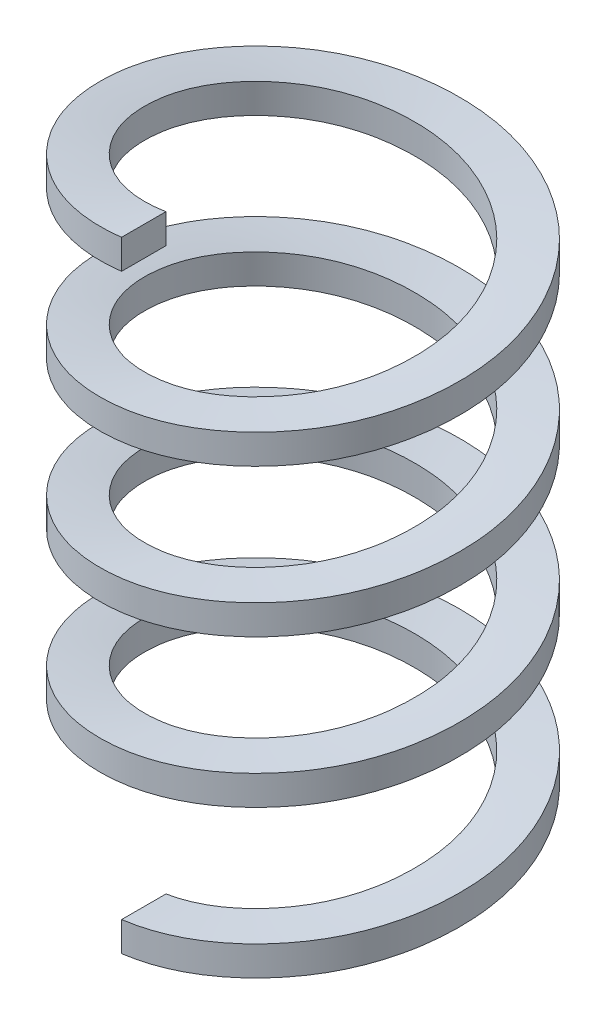
ISO-10303-21;
HEADER;
FILE_DESCRIPTION(('STEP AP214'),'2;1');
FILE_NAME('part.step','',(''),(''),'','','');
FILE_SCHEMA(('AUTOMOTIVE_DESIGN { 1 0 10303 214 1 1 1 1 }'));
ENDSEC;
DATA;
#1=APPLICATION_CONTEXT('core data for automotive mechanical design processes');
#2=APPLICATION_PROTOCOL_DEFINITION('international standard','automotive_design',2000,#1);
#3=PRODUCT_CONTEXT('',#1,'mechanical');
#4=PRODUCT('Part','Part','',(#3));
#5=PRODUCT_RELATED_PRODUCT_CATEGORY('part','',(#4));
#6=PRODUCT_DEFINITION_FORMATION('','',#4);
#7=PRODUCT_DEFINITION_CONTEXT('part definition',#1,'design');
#8=PRODUCT_DEFINITION('design','',#6,#7);
#9=PRODUCT_DEFINITION_SHAPE('','',#8);
#10=(LENGTH_UNIT() NAMED_UNIT(*) SI_UNIT(.MILLI.,.METRE.));
#11=(NAMED_UNIT(*) PLANE_ANGLE_UNIT() SI_UNIT($,.RADIAN.));
#12=(NAMED_UNIT(*) SI_UNIT($,.STERADIAN.) SOLID_ANGLE_UNIT());
#13=UNCERTAINTY_MEASURE_WITH_UNIT(LENGTH_MEASURE(1.E-05),#10,'distance_accuracy_value','');
#14=(GEOMETRIC_REPRESENTATION_CONTEXT(3) GLOBAL_UNCERTAINTY_ASSIGNED_CONTEXT((#13)) GLOBAL_UNIT_ASSIGNED_CONTEXT((#10,
#11,#12)) REPRESENTATION_CONTEXT('',''));
#15=CARTESIAN_POINT('',(0.,0.,0.));
#16=DIRECTION('',(0.,0.,1.));
#17=DIRECTION('',(1.,0.,0.));
#18=AXIS2_PLACEMENT_3D('',#15,#16,#17);
#19=CARTESIAN_POINT('',(0.,-69.85,13.686869772002));
#20=DIRECTION('',(1.,0.,0.));
#21=DIRECTION('',(0.,1.,0.));
#22=AXIS2_PLACEMENT_3D('',#19,#20,#21);
#23=PLANE('',#22);
#24=DIRECTION('',(0.,0.,1.));
#25=VECTOR('',#24,1.);
#26=CARTESIAN_POINT('',(0.,-71.12,13.7215008808548));
#27=LINE('',#26,#25);
#28=CARTESIAN_POINT('',(0.,-71.12,15.591869772002));
#29=VERTEX_POINT('',#28);
#30=CARTESIAN_POINT('',(0.,-71.12,11.781869772002));
#31=VERTEX_POINT('',#30);
#32=EDGE_CURVE('E74',#29,#31,#27,.F.);
#33=ORIENTED_EDGE('',*,*,#32,.F.);
#34=DIRECTION('',(0.,1.,0.));
#35=VECTOR('',#34,1.);
#36=CARTESIAN_POINT('',(0.,-70.358,15.591869772002));
#37=LINE('',#36,#35);
#38=CARTESIAN_POINT('',(0.,-68.58,15.591869772002));
#39=VERTEX_POINT('',#38);
#40=EDGE_CURVE('E58',#39,#29,#37,.F.);
#41=ORIENTED_EDGE('',*,*,#40,.F.);
#42=DIRECTION('',(0.,0.,1.));
#43=VECTOR('',#42,1.);
#44=CARTESIAN_POINT('',(0.,-68.58,13.7215008808548));
#45=LINE('',#44,#43);
#46=CARTESIAN_POINT('',(0.,-68.58,11.781869772002));
#47=VERTEX_POINT('',#46);
#48=EDGE_CURVE('E64',#47,#39,#45,.T.);
#49=ORIENTED_EDGE('',*,*,#48,.F.);
#50=DIRECTION('',(0.,1.,0.));
#51=VECTOR('',#50,1.);
#52=CARTESIAN_POINT('',(0.,-70.358,11.781869772002));
#53=LINE('',#52,#51);
#54=EDGE_CURVE('E70',#31,#47,#53,.T.);
#55=ORIENTED_EDGE('',*,*,#54,.F.);
#56=EDGE_LOOP('',(#33,#41,#49,#55));
#57=FACE_BOUND('',#56,.T.);
#58=ADVANCED_FACE('F16',(#57),#23,.F.);
#59=CARTESIAN_POINT('',(0.,-19.05,13.686869772002));
#60=DIRECTION('',(1.,0.,0.));
#61=DIRECTION('',(0.,1.,0.));
#62=AXIS2_PLACEMENT_3D('',#59,#60,#61);
#63=PLANE('',#62);
#64=DIRECTION('',(0.,0.,1.));
#65=VECTOR('',#64,1.);
#66=CARTESIAN_POINT('',(0.,-20.32,13.7215008808548));
#67=LINE('',#66,#65);
#68=CARTESIAN_POINT('',(0.,-20.32,15.591869772002));
#69=VERTEX_POINT('',#68);
#70=CARTESIAN_POINT('',(0.,-20.32,11.781869772002));
#71=VERTEX_POINT('',#70);
#72=EDGE_CURVE('E91',#69,#71,#67,.F.);
#73=ORIENTED_EDGE('',*,*,#72,.T.);
#74=DIRECTION('',(0.,1.,0.));
#75=VECTOR('',#74,1.);
#76=CARTESIAN_POINT('',(0.,-19.558,11.781869772002));
#77=LINE('',#76,#75);
#78=CARTESIAN_POINT('',(0.,-17.78,11.781869772002));
#79=VERTEX_POINT('',#78);
#80=EDGE_CURVE('E44',#71,#79,#77,.T.);
#81=ORIENTED_EDGE('',*,*,#80,.T.);
#82=DIRECTION('',(0.,0.,1.));
#83=VECTOR('',#82,1.);
#84=CARTESIAN_POINT('',(0.,-17.78,13.7215008808548));
#85=LINE('',#84,#83);
#86=CARTESIAN_POINT('',(0.,-17.78,15.591869772002));
#87=VERTEX_POINT('',#86);
#88=EDGE_CURVE('E24',#79,#87,#85,.T.);
#89=ORIENTED_EDGE('',*,*,#88,.T.);
#90=DIRECTION('',(0.,1.,0.));
#91=VECTOR('',#90,1.);
#92=CARTESIAN_POINT('',(0.,-19.558,15.591869772002));
#93=LINE('',#92,#91);
#94=EDGE_CURVE('E10',#87,#69,#93,.F.);
#95=ORIENTED_EDGE('',*,*,#94,.T.);
#96=EDGE_LOOP('',(#73,#81,#89,#95));
#97=FACE_BOUND('',#96,.T.);
#98=ADVANCED_FACE('F134',(#97),#63,.T.);
#99=CARTESIAN_POINT('',(0.,-71.12,15.591869772002));
#100=CARTESIAN_POINT('',(6.45836392231832,-70.32625,15.591869772002));
#101=CARTESIAN_POINT('',(11.0251168471601,-69.5325,11.0251168471601));
#102=CARTESIAN_POINT('',(15.591869772002,-68.73875,6.45836392231832));
#103=CARTESIAN_POINT('',(15.591869772002,-67.945,0.));
#104=CARTESIAN_POINT('',(15.591869772002,-67.15125,-6.45836392231832));
#105=CARTESIAN_POINT('',(11.0251168471601,-66.3575,-11.0251168471601));
#106=CARTESIAN_POINT('',(6.45836392231832,-65.56375,-15.591869772002));
#107=CARTESIAN_POINT('',(0.,-64.77,-15.591869772002));
#108=CARTESIAN_POINT('',(-6.45836392231832,-63.97625,-15.591869772002));
#109=CARTESIAN_POINT('',(-11.0251168471601,-63.1825,-11.0251168471601));
#110=CARTESIAN_POINT('',(-15.591869772002,-62.3887500000001,-6.45836392231833));
#111=CARTESIAN_POINT('',(-15.591869772002,-61.595,0.));
#112=CARTESIAN_POINT('',(-15.591869772002,-60.80125,6.45836392231832));
#113=CARTESIAN_POINT('',(-11.0251168471601,-60.0075,11.0251168471601));
#114=CARTESIAN_POINT('',(-6.45836392231833,-59.21375,15.591869772002));
#115=CARTESIAN_POINT('',(0.,-58.42,15.591869772002));
#116=CARTESIAN_POINT('',(6.45836392231832,-57.6262500000001,15.591869772002));
#117=CARTESIAN_POINT('',(11.0251168471601,-56.8325,11.0251168471601));
#118=CARTESIAN_POINT('',(15.591869772002,-56.03875,6.45836392231832));
#119=CARTESIAN_POINT('',(15.591869772002,-55.245,0.));
#120=CARTESIAN_POINT('',(15.591869772002,-54.45125,-6.45836392231832));
#121=CARTESIAN_POINT('',(11.0251168471601,-53.6575,-11.0251168471601));
#122=CARTESIAN_POINT('',(6.45836392231832,-52.8637500000001,-15.591869772002));
#123=CARTESIAN_POINT('',(0.,-52.07,-15.591869772002));
#124=CARTESIAN_POINT('',(-6.45836392231832,-51.27625,-15.591869772002));
#125=CARTESIAN_POINT('',(-11.0251168471601,-50.4825,-11.0251168471601));
#126=CARTESIAN_POINT('',(-15.591869772002,-49.68875,-6.45836392231833));
#127=CARTESIAN_POINT('',(-15.591869772002,-48.895,0.));
#128=CARTESIAN_POINT('',(-15.591869772002,-48.10125,6.45836392231832));
#129=CARTESIAN_POINT('',(-11.0251168471601,-47.3075,11.0251168471601));
#130=CARTESIAN_POINT('',(-6.45836392231833,-46.51375,15.591869772002));
#131=CARTESIAN_POINT('',(0.,-45.72,15.591869772002));
#132=CARTESIAN_POINT('',(6.45836392231832,-44.92625,15.591869772002));
#133=CARTESIAN_POINT('',(11.0251168471601,-44.1325,11.0251168471601));
#134=CARTESIAN_POINT('',(15.591869772002,-43.33875,6.45836392231832));
#135=CARTESIAN_POINT('',(15.591869772002,-42.545,0.));
#136=CARTESIAN_POINT('',(15.591869772002,-41.75125,-6.45836392231832));
#137=CARTESIAN_POINT('',(11.0251168471601,-40.9575,-11.0251168471601));
#138=CARTESIAN_POINT('',(6.45836392231832,-40.16375,-15.591869772002));
#139=CARTESIAN_POINT('',(0.,-39.37,-15.591869772002));
#140=CARTESIAN_POINT('',(-6.45836392231832,-38.57625,-15.591869772002));
#141=CARTESIAN_POINT('',(-11.0251168471601,-37.7825,-11.0251168471601));
#142=CARTESIAN_POINT('',(-15.591869772002,-36.98875,-6.45836392231833));
#143=CARTESIAN_POINT('',(-15.591869772002,-36.195,0.));
#144=CARTESIAN_POINT('',(-15.591869772002,-35.40125,6.45836392231832));
#145=CARTESIAN_POINT('',(-11.0251168471601,-34.6075,11.0251168471601));
#146=CARTESIAN_POINT('',(-6.45836392231833,-33.81375,15.591869772002));
#147=CARTESIAN_POINT('',(0.,-33.02,15.591869772002));
#148=CARTESIAN_POINT('',(6.45836392231832,-32.22625,15.591869772002));
#149=CARTESIAN_POINT('',(11.0251168471601,-31.4325,11.0251168471601));
#150=CARTESIAN_POINT('',(15.591869772002,-30.63875,6.45836392231832));
#151=CARTESIAN_POINT('',(15.591869772002,-29.845,0.));
#152=CARTESIAN_POINT('',(15.591869772002,-29.05125,-6.45836392231832));
#153=CARTESIAN_POINT('',(11.0251168471601,-28.2575,-11.0251168471601));
#154=CARTESIAN_POINT('',(6.45836392231832,-27.46375,-15.591869772002));
#155=CARTESIAN_POINT('',(0.,-26.67,-15.591869772002));
#156=CARTESIAN_POINT('',(-6.45836392231832,-25.87625,-15.591869772002));
#157=CARTESIAN_POINT('',(-11.0251168471601,-25.0825,-11.0251168471601));
#158=CARTESIAN_POINT('',(-15.591869772002,-24.28875,-6.45836392231833));
#159=CARTESIAN_POINT('',(-15.591869772002,-23.495,0.));
#160=CARTESIAN_POINT('',(-15.591869772002,-22.70125,6.45836392231832));
#161=CARTESIAN_POINT('',(-11.0251168471601,-21.9075,11.0251168471601));
#162=CARTESIAN_POINT('',(-6.45836392231833,-21.11375,15.591869772002));
#163=CARTESIAN_POINT('',(0.,-20.32,15.591869772002));
#164=CARTESIAN_POINT('',(0.,-71.12,11.781869772002));
#165=CARTESIAN_POINT('',(4.88021024967683,-70.32625,11.781869772002));
#166=CARTESIAN_POINT('',(8.3310400108394,-69.5325,8.3310400108394));
#167=CARTESIAN_POINT('',(11.781869772002,-68.73875,4.88021024967683));
#168=CARTESIAN_POINT('',(11.781869772002,-67.945,0.));
#169=CARTESIAN_POINT('',(11.781869772002,-67.15125,-4.88021024967682));
#170=CARTESIAN_POINT('',(8.3310400108394,-66.3575,-8.3310400108394));
#171=CARTESIAN_POINT('',(4.88021024967683,-65.56375,-11.781869772002));
#172=CARTESIAN_POINT('',(0.,-64.77,-11.781869772002));
#173=CARTESIAN_POINT('',(-4.88021024967682,-63.97625,-11.781869772002));
#174=CARTESIAN_POINT('',(-8.3310400108394,-63.1825,-8.3310400108394));
#175=CARTESIAN_POINT('',(-11.781869772002,-62.3887500000001,-4.88021024967683));
#176=CARTESIAN_POINT('',(-11.781869772002,-61.595,0.));
#177=CARTESIAN_POINT('',(-11.781869772002,-60.80125,4.88021024967683));
#178=CARTESIAN_POINT('',(-8.3310400108394,-60.0075,8.3310400108394));
#179=CARTESIAN_POINT('',(-4.88021024967683,-59.21375,11.781869772002));
#180=CARTESIAN_POINT('',(0.,-58.42,11.781869772002));
#181=CARTESIAN_POINT('',(4.88021024967683,-57.6262500000001,11.781869772002));
#182=CARTESIAN_POINT('',(8.3310400108394,-56.8325,8.3310400108394));
#183=CARTESIAN_POINT('',(11.781869772002,-56.03875,4.88021024967683));
#184=CARTESIAN_POINT('',(11.781869772002,-55.245,0.));
#185=CARTESIAN_POINT('',(11.781869772002,-54.45125,-4.88021024967682));
#186=CARTESIAN_POINT('',(8.3310400108394,-53.6575,-8.3310400108394));
#187=CARTESIAN_POINT('',(4.88021024967683,-52.8637500000001,-11.781869772002));
#188=CARTESIAN_POINT('',(0.,-52.07,-11.781869772002));
#189=CARTESIAN_POINT('',(-4.88021024967682,-51.27625,-11.781869772002));
#190=CARTESIAN_POINT('',(-8.3310400108394,-50.4825,-8.3310400108394));
#191=CARTESIAN_POINT('',(-11.781869772002,-49.68875,-4.88021024967683));
#192=CARTESIAN_POINT('',(-11.781869772002,-48.895,0.));
#193=CARTESIAN_POINT('',(-11.781869772002,-48.10125,4.88021024967683));
#194=CARTESIAN_POINT('',(-8.3310400108394,-47.3075,8.3310400108394));
#195=CARTESIAN_POINT('',(-4.88021024967683,-46.51375,11.781869772002));
#196=CARTESIAN_POINT('',(0.,-45.72,11.781869772002));
#197=CARTESIAN_POINT('',(4.88021024967683,-44.92625,11.781869772002));
#198=CARTESIAN_POINT('',(8.3310400108394,-44.1325,8.3310400108394));
#199=CARTESIAN_POINT('',(11.781869772002,-43.33875,4.88021024967683));
#200=CARTESIAN_POINT('',(11.781869772002,-42.545,0.));
#201=CARTESIAN_POINT('',(11.781869772002,-41.75125,-4.88021024967682));
#202=CARTESIAN_POINT('',(8.3310400108394,-40.9575,-8.3310400108394));
#203=CARTESIAN_POINT('',(4.88021024967683,-40.16375,-11.781869772002));
#204=CARTESIAN_POINT('',(0.,-39.37,-11.781869772002));
#205=CARTESIAN_POINT('',(-4.88021024967682,-38.57625,-11.781869772002));
#206=CARTESIAN_POINT('',(-8.3310400108394,-37.7825,-8.3310400108394));
#207=CARTESIAN_POINT('',(-11.781869772002,-36.98875,-4.88021024967683));
#208=CARTESIAN_POINT('',(-11.781869772002,-36.195,0.));
#209=CARTESIAN_POINT('',(-11.781869772002,-35.40125,4.88021024967683));
#210=CARTESIAN_POINT('',(-8.3310400108394,-34.6075,8.3310400108394));
#211=CARTESIAN_POINT('',(-4.88021024967683,-33.81375,11.781869772002));
#212=CARTESIAN_POINT('',(0.,-33.02,11.781869772002));
#213=CARTESIAN_POINT('',(4.88021024967683,-32.22625,11.781869772002));
#214=CARTESIAN_POINT('',(8.3310400108394,-31.4325,8.3310400108394));
#215=CARTESIAN_POINT('',(11.781869772002,-30.63875,4.88021024967683));
#216=CARTESIAN_POINT('',(11.781869772002,-29.845,0.));
#217=CARTESIAN_POINT('',(11.781869772002,-29.05125,-4.88021024967682));
#218=CARTESIAN_POINT('',(8.3310400108394,-28.2575,-8.3310400108394));
#219=CARTESIAN_POINT('',(4.88021024967683,-27.46375,-11.781869772002));
#220=CARTESIAN_POINT('',(0.,-26.67,-11.781869772002));
#221=CARTESIAN_POINT('',(-4.88021024967682,-25.87625,-11.781869772002));
#222=CARTESIAN_POINT('',(-8.3310400108394,-25.0825,-8.3310400108394));
#223=CARTESIAN_POINT('',(-11.781869772002,-24.28875,-4.88021024967683));
#224=CARTESIAN_POINT('',(-11.781869772002,-23.495,0.));
#225=CARTESIAN_POINT('',(-11.781869772002,-22.70125,4.88021024967683));
#226=CARTESIAN_POINT('',(-8.3310400108394,-21.9075,8.3310400108394));
#227=CARTESIAN_POINT('',(-4.88021024967683,-21.11375,11.781869772002));
#228=CARTESIAN_POINT('',(0.,-20.32,11.781869772002));
#229=(BOUNDED_SURFACE() B_SPLINE_SURFACE(1,2,((#99,#100,#101,#102,#103,#104,#105,#106,#107,#108,
#109,#110,#111,#112,#113,#114,#115,#116,#117,#118,#119,#120,#121,#122,#123,#124,#125,#126,#127,
#128,#129,#130,#131,#132,#133,#134,#135,#136,#137,#138,#139,#140,#141,#142,#143,#144,#145,#146,
#147,#148,#149,#150,#151,#152,#153,#154,#155,#156,#157,#158,#159,#160,#161,#162,#163),(#164,
#165,#166,#167,#168,#169,#170,#171,#172,#173,#174,#175,#176,#177,#178,#179,#180,#181,#182,#183,
#184,#185,#186,#187,#188,#189,#190,#191,#192,#193,#194,#195,#196,#197,#198,#199,#200,#201,#202,
#203,#204,#205,#206,#207,#208,#209,#210,#211,#212,#213,#214,#215,#216,#217,#218,#219,#220,#221,
#222,#223,#224,#225,#226,#227,#228)),.UNSPECIFIED.,.F.,.F.,.F.) B_SPLINE_SURFACE_WITH_KNOTS((2,
2),(3,2,2,2,2,2,2,2,2,2,2,2,2,2,2,2,2,2,2,2,2,2,2,2,2,2,2,2,2,2,2,2,3),(0.,1.),(0.,0.03125,
0.0625,0.09375,0.125,0.15625,0.1875,0.21875,0.25,0.28125,0.3125,0.34375,0.375,0.40625,0.4375,
0.46875,0.5,0.53125,0.5625,0.59375,0.625,0.65625,0.6875,0.71875,0.75,0.78125,0.8125,0.84375,
0.875,0.90625,0.9375,0.96875,1.),
.UNSPECIFIED.) GEOMETRIC_REPRESENTATION_ITEM() RATIONAL_B_SPLINE_SURFACE(((1.,0.923879532511287,
1.,0.923879532511287,1.,0.923879532511287,1.,0.923879532511287,1.,0.923879532511287,1.,
0.923879532511287,1.,0.923879532511287,1.,0.923879532511287,1.,0.923879532511287,1.,
0.923879532511287,1.,0.923879532511287,1.,0.923879532511287,1.,0.923879532511287,1.,
0.923879532511287,1.,0.923879532511287,1.,0.923879532511287,1.,0.923879532511287,1.,
0.923879532511287,1.,0.923879532511287,1.,0.923879532511287,1.,0.923879532511287,1.,
0.923879532511287,1.,0.923879532511287,1.,0.923879532511287,1.,0.923879532511287,1.,
0.923879532511287,1.,0.923879532511287,1.,0.923879532511287,1.,0.923879532511287,1.,
0.923879532511287,1.,0.923879532511287,1.,0.923879532511287,1.),(1.,0.923879532511287,1.,
0.923879532511287,1.,0.923879532511287,1.,0.923879532511287,1.,0.923879532511287,1.,
0.923879532511287,1.,0.923879532511287,1.,0.923879532511287,1.,0.923879532511287,1.,
0.923879532511287,1.,0.923879532511287,1.,0.923879532511287,1.,0.923879532511287,1.,
0.923879532511287,1.,0.923879532511287,1.,0.923879532511287,1.,0.923879532511287,1.,
0.923879532511287,1.,0.923879532511287,1.,0.923879532511287,1.,0.923879532511287,1.,
0.923879532511287,1.,0.923879532511287,1.,0.923879532511287,1.,0.923879532511287,1.,
0.923879532511287,1.,0.923879532511287,1.,0.923879532511287,1.,0.923879532511287,1.,
0.923879532511287,1.,0.923879532511287,1.,0.923879532511287,1.))) REPRESENTATION_ITEM('') SURFACE());
#230=CARTESIAN_POINT('',(0.,-71.12,11.781869772002));
#231=CARTESIAN_POINT('',(4.88021024967683,-70.32625,11.781869772002));
#232=CARTESIAN_POINT('',(8.3310400108394,-69.5325,8.3310400108394));
#233=CARTESIAN_POINT('',(11.781869772002,-68.73875,4.88021024967683));
#234=CARTESIAN_POINT('',(11.781869772002,-67.945,0.));
#235=CARTESIAN_POINT('',(11.781869772002,-67.15125,-4.88021024967682));
#236=CARTESIAN_POINT('',(8.3310400108394,-66.3575,-8.3310400108394));
#237=CARTESIAN_POINT('',(4.88021024967683,-65.56375,-11.781869772002));
#238=CARTESIAN_POINT('',(0.,-64.77,-11.781869772002));
#239=CARTESIAN_POINT('',(-4.88021024967682,-63.97625,-11.781869772002));
#240=CARTESIAN_POINT('',(-8.3310400108394,-63.1825,-8.3310400108394));
#241=CARTESIAN_POINT('',(-11.781869772002,-62.3887500000001,-4.88021024967683));
#242=CARTESIAN_POINT('',(-11.781869772002,-61.595,0.));
#243=CARTESIAN_POINT('',(-11.781869772002,-60.80125,4.88021024967683));
#244=CARTESIAN_POINT('',(-8.3310400108394,-60.0075,8.3310400108394));
#245=CARTESIAN_POINT('',(-4.88021024967683,-59.21375,11.781869772002));
#246=CARTESIAN_POINT('',(0.,-58.42,11.781869772002));
#247=CARTESIAN_POINT('',(4.88021024967683,-57.6262500000001,11.781869772002));
#248=CARTESIAN_POINT('',(8.3310400108394,-56.8325,8.3310400108394));
#249=CARTESIAN_POINT('',(11.781869772002,-56.03875,4.88021024967683));
#250=CARTESIAN_POINT('',(11.781869772002,-55.245,0.));
#251=CARTESIAN_POINT('',(11.781869772002,-54.45125,-4.88021024967683));
#252=CARTESIAN_POINT('',(8.33104001083941,-53.6575,-8.33104001083939));
#253=CARTESIAN_POINT('',(4.88021024967683,-52.8637500000001,-11.781869772002));
#254=CARTESIAN_POINT('',(0.,-52.07,-11.781869772002));
#255=CARTESIAN_POINT('',(-4.88021024967683,-51.27625,-11.781869772002));
#256=CARTESIAN_POINT('',(-8.33104001083941,-50.4825,-8.3310400108394));
#257=CARTESIAN_POINT('',(-11.781869772002,-49.68875,-4.88021024967683));
#258=CARTESIAN_POINT('',(-11.781869772002,-48.895,0.));
#259=CARTESIAN_POINT('',(-11.781869772002,-48.10125,4.88021024967683));
#260=CARTESIAN_POINT('',(-8.33104001083941,-47.3075,8.33104001083939));
#261=CARTESIAN_POINT('',(-4.88021024967683,-46.51375,11.781869772002));
#262=CARTESIAN_POINT('',(0.,-45.72,11.781869772002));
#263=CARTESIAN_POINT('',(4.88021024967682,-44.92625,11.781869772002));
#264=CARTESIAN_POINT('',(8.3310400108394,-44.1325,8.3310400108394));
#265=CARTESIAN_POINT('',(11.781869772002,-43.33875,4.88021024967684));
#266=CARTESIAN_POINT('',(11.781869772002,-42.545,0.));
#267=CARTESIAN_POINT('',(11.781869772002,-41.75125,-4.88021024967682));
#268=CARTESIAN_POINT('',(8.33104001083941,-40.9575,-8.33104001083939));
#269=CARTESIAN_POINT('',(4.88021024967684,-40.16375,-11.781869772002));
#270=CARTESIAN_POINT('',(0.,-39.37,-11.781869772002));
#271=CARTESIAN_POINT('',(-4.8802102496768,-38.57625,-11.781869772002));
#272=CARTESIAN_POINT('',(-8.3310400108394,-37.7825,-8.3310400108394));
#273=CARTESIAN_POINT('',(-11.781869772002,-36.98875,-4.88021024967684));
#274=CARTESIAN_POINT('',(-11.781869772002,-36.195,0.));
#275=CARTESIAN_POINT('',(-11.781869772002,-35.40125,4.88021024967682));
#276=CARTESIAN_POINT('',(-8.33104001083941,-34.6075,8.33104001083939));
#277=CARTESIAN_POINT('',(-4.88021024967682,-33.81375,11.781869772002));
#278=CARTESIAN_POINT('',(0.,-33.02,11.781869772002));
#279=CARTESIAN_POINT('',(4.8802102496768,-32.22625,11.781869772002));
#280=CARTESIAN_POINT('',(8.3310400108394,-31.4325,8.3310400108394));
#281=CARTESIAN_POINT('',(11.781869772002,-30.63875,4.88021024967684));
#282=CARTESIAN_POINT('',(11.781869772002,-29.845,0.));
#283=CARTESIAN_POINT('',(11.781869772002,-29.05125,-4.88021024967682));
#284=CARTESIAN_POINT('',(8.33104001083941,-28.2575,-8.33104001083939));
#285=CARTESIAN_POINT('',(4.88021024967682,-27.46375,-11.781869772002));
#286=CARTESIAN_POINT('',(0.,-26.67,-11.781869772002));
#287=CARTESIAN_POINT('',(-4.8802102496768,-25.87625,-11.781869772002));
#288=CARTESIAN_POINT('',(-8.3310400108394,-25.0825,-8.3310400108394));
#289=CARTESIAN_POINT('',(-11.781869772002,-24.28875,-4.88021024967684));
#290=CARTESIAN_POINT('',(-11.781869772002,-23.495,0.));
#291=CARTESIAN_POINT('',(-11.781869772002,-22.70125,4.88021024967682));
#292=CARTESIAN_POINT('',(-8.33104001083942,-21.9075,8.33104001083939));
#293=CARTESIAN_POINT('',(-4.88021024967682,-21.11375,11.781869772002));
#294=CARTESIAN_POINT('',(0.,-20.32,11.781869772002));
#295=(BOUNDED_CURVE() B_SPLINE_CURVE(2,(#230,#231,#232,#233,#234,#235,#236,#237,#238,#239,#240,
#241,#242,#243,#244,#245,#246,#247,#248,#249,#250,#251,#252,#253,#254,#255,#256,#257,#258,#259,
#260,#261,#262,#263,#264,#265,#266,#267,#268,#269,#270,#271,#272,#273,#274,#275,#276,#277,#278,
#279,#280,#281,#282,#283,#284,#285,#286,#287,#288,#289,#290,#291,#292,#293,#294),.UNSPECIFIED.,
.F.,.F.) B_SPLINE_CURVE_WITH_KNOTS((3,2,2,2,2,2,2,2,2,2,2,2,2,2,2,2,2,2,2,2,2,2,2,2,2,2,2,2,2,2,
2,2,3),(0.,0.03125,0.0625,0.09375,0.125,0.15625,0.1875,0.21875,0.25,0.28125,0.3125,0.34375,
0.375,0.40625,0.4375,0.46875,0.5,0.53125,0.5625,0.59375,0.625,0.65625,0.6875,0.71875,0.75,
0.78125,0.8125,0.84375,0.875,0.90625,0.9375,0.96875,1.),
.UNSPECIFIED.) CURVE() GEOMETRIC_REPRESENTATION_ITEM() RATIONAL_B_SPLINE_CURVE((1.,
0.923879532511287,1.,0.923879532511287,1.,0.923879532511287,1.,0.923879532511287,1.,
0.923879532511287,1.,0.923879532511287,1.,0.923879532511287,1.,0.923879532511287,1.,
0.923879532511287,1.,0.923879532511287,1.,0.923879532511287,1.,0.923879532511287,1.,
0.923879532511287,1.,0.923879532511287,1.,0.923879532511287,1.,0.923879532511287,1.,
0.923879532511287,1.,0.923879532511287,1.,0.923879532511287,1.,0.923879532511287,1.,
0.923879532511287,1.,0.923879532511287,1.,0.923879532511287,1.,0.923879532511287,1.,
0.923879532511287,1.,0.923879532511287,1.,0.923879532511287,1.,0.923879532511287,1.,
0.923879532511287,1.,0.923879532511287,1.,0.923879532511287,1.,0.923879532511287,1.)) REPRESENTATION_ITEM(''));
#296=EDGE_CURVE('E93',#31,#71,#295,.T.);
#297=CARTESIAN_POINT('',(0.,-71.12,15.591869772002));
#298=CARTESIAN_POINT('',(6.45836392231832,-70.32625,15.591869772002));
#299=CARTESIAN_POINT('',(11.0251168471601,-69.5325,11.0251168471601));
#300=CARTESIAN_POINT('',(15.591869772002,-68.73875,6.45836392231832));
#301=CARTESIAN_POINT('',(15.591869772002,-67.945,0.));
#302=CARTESIAN_POINT('',(15.591869772002,-67.15125,-6.45836392231832));
#303=CARTESIAN_POINT('',(11.0251168471601,-66.3575,-11.0251168471601));
#304=CARTESIAN_POINT('',(6.45836392231832,-65.56375,-15.591869772002));
#305=CARTESIAN_POINT('',(0.,-64.77,-15.591869772002));
#306=CARTESIAN_POINT('',(-6.45836392231832,-63.97625,-15.591869772002));
#307=CARTESIAN_POINT('',(-11.0251168471601,-63.1825,-11.0251168471601));
#308=CARTESIAN_POINT('',(-15.591869772002,-62.3887500000001,-6.45836392231833));
#309=CARTESIAN_POINT('',(-15.591869772002,-61.595,0.));
#310=CARTESIAN_POINT('',(-15.591869772002,-60.80125,6.45836392231832));
#311=CARTESIAN_POINT('',(-11.0251168471601,-60.0075,11.0251168471601));
#312=CARTESIAN_POINT('',(-6.45836392231833,-59.21375,15.591869772002));
#313=CARTESIAN_POINT('',(0.,-58.42,15.591869772002));
#314=CARTESIAN_POINT('',(6.45836392231832,-57.6262500000001,15.591869772002));
#315=CARTESIAN_POINT('',(11.0251168471601,-56.8325,11.0251168471601));
#316=CARTESIAN_POINT('',(15.591869772002,-56.03875,6.45836392231833));
#317=CARTESIAN_POINT('',(15.591869772002,-55.245,0.));
#318=CARTESIAN_POINT('',(15.591869772002,-54.45125,-6.45836392231832));
#319=CARTESIAN_POINT('',(11.0251168471602,-53.6575,-11.0251168471601));
#320=CARTESIAN_POINT('',(6.45836392231833,-52.8637500000001,-15.591869772002));
#321=CARTESIAN_POINT('',(0.,-52.07,-15.591869772002));
#322=CARTESIAN_POINT('',(-6.45836392231832,-51.27625,-15.591869772002));
#323=CARTESIAN_POINT('',(-11.0251168471601,-50.4825,-11.0251168471601));
#324=CARTESIAN_POINT('',(-15.591869772002,-49.68875,-6.45836392231833));
#325=CARTESIAN_POINT('',(-15.591869772002,-48.895,0.));
#326=CARTESIAN_POINT('',(-15.591869772002,-48.10125,6.45836392231832));
#327=CARTESIAN_POINT('',(-11.0251168471602,-47.3075,11.0251168471601));
#328=CARTESIAN_POINT('',(-6.45836392231833,-46.51375,15.591869772002));
#329=CARTESIAN_POINT('',(0.,-45.72,15.591869772002));
#330=CARTESIAN_POINT('',(6.45836392231832,-44.92625,15.591869772002));
#331=CARTESIAN_POINT('',(11.0251168471601,-44.1325,11.0251168471601));
#332=CARTESIAN_POINT('',(15.591869772002,-43.33875,6.45836392231833));
#333=CARTESIAN_POINT('',(15.591869772002,-42.545,0.));
#334=CARTESIAN_POINT('',(15.591869772002,-41.75125,-6.45836392231832));
#335=CARTESIAN_POINT('',(11.0251168471602,-40.9575,-11.0251168471601));
#336=CARTESIAN_POINT('',(6.45836392231833,-40.16375,-15.591869772002));
#337=CARTESIAN_POINT('',(0.,-39.37,-15.591869772002));
#338=CARTESIAN_POINT('',(-6.45836392231829,-38.57625,-15.591869772002));
#339=CARTESIAN_POINT('',(-11.0251168471601,-37.7825,-11.0251168471601));
#340=CARTESIAN_POINT('',(-15.591869772002,-36.98875,-6.45836392231833));
#341=CARTESIAN_POINT('',(-15.591869772002,-36.195,0.));
#342=CARTESIAN_POINT('',(-15.591869772002,-35.40125,6.45836392231831));
#343=CARTESIAN_POINT('',(-11.0251168471602,-34.6075,11.0251168471601));
#344=CARTESIAN_POINT('',(-6.45836392231831,-33.81375,15.591869772002));
#345=CARTESIAN_POINT('',(0.,-33.02,15.591869772002));
#346=CARTESIAN_POINT('',(6.45836392231829,-32.22625,15.591869772002));
#347=CARTESIAN_POINT('',(11.0251168471601,-31.4325,11.0251168471601));
#348=CARTESIAN_POINT('',(15.591869772002,-30.63875,6.45836392231833));
#349=CARTESIAN_POINT('',(15.591869772002,-29.845,0.));
#350=CARTESIAN_POINT('',(15.591869772002,-29.05125,-6.45836392231831));
#351=CARTESIAN_POINT('',(11.0251168471602,-28.2575,-11.0251168471601));
#352=CARTESIAN_POINT('',(6.45836392231831,-27.46375,-15.591869772002));
#353=CARTESIAN_POINT('',(0.,-26.67,-15.591869772002));
#354=CARTESIAN_POINT('',(-6.45836392231829,-25.87625,-15.591869772002));
#355=CARTESIAN_POINT('',(-11.0251168471601,-25.0825,-11.0251168471601));
#356=CARTESIAN_POINT('',(-15.591869772002,-24.28875,-6.45836392231834));
#357=CARTESIAN_POINT('',(-15.591869772002,-23.495,0.));
#358=CARTESIAN_POINT('',(-15.591869772002,-22.70125,6.45836392231831));
#359=CARTESIAN_POINT('',(-11.0251168471602,-21.9075,11.0251168471601));
#360=CARTESIAN_POINT('',(-6.45836392231831,-21.11375,15.591869772002));
#361=CARTESIAN_POINT('',(0.,-20.32,15.591869772002));
#362=(BOUNDED_CURVE() B_SPLINE_CURVE(2,(#297,#298,#299,#300,#301,#302,#303,#304,#305,#306,#307,
#308,#309,#310,#311,#312,#313,#314,#315,#316,#317,#318,#319,#320,#321,#322,#323,#324,#325,#326,
#327,#328,#329,#330,#331,#332,#333,#334,#335,#336,#337,#338,#339,#340,#341,#342,#343,#344,#345,
#346,#347,#348,#349,#350,#351,#352,#353,#354,#355,#356,#357,#358,#359,#360,#361),.UNSPECIFIED.,
.F.,.F.) B_SPLINE_CURVE_WITH_KNOTS((3,2,2,2,2,2,2,2,2,2,2,2,2,2,2,2,2,2,2,2,2,2,2,2,2,2,2,2,2,2,
2,2,3),(0.,0.03125,0.0625,0.09375,0.125,0.15625,0.1875,0.21875,0.25,0.28125,0.3125,0.34375,
0.375,0.40625,0.4375,0.46875,0.5,0.53125,0.5625,0.59375,0.625,0.65625,0.6875,0.71875,0.75,
0.78125,0.8125,0.84375,0.875,0.90625,0.9375,0.96875,1.),
.UNSPECIFIED.) CURVE() GEOMETRIC_REPRESENTATION_ITEM() RATIONAL_B_SPLINE_CURVE((1.,
0.923879532511287,1.,0.923879532511287,1.,0.923879532511287,1.,0.923879532511287,1.,
0.923879532511287,1.,0.923879532511287,1.,0.923879532511287,1.,0.923879532511287,1.,
0.923879532511287,1.,0.923879532511287,1.,0.923879532511287,1.,0.923879532511287,1.,
0.923879532511287,1.,0.923879532511287,1.,0.923879532511287,1.,0.923879532511287,1.,
0.923879532511287,1.,0.923879532511287,1.,0.923879532511287,1.,0.923879532511287,1.,
0.923879532511287,1.,0.923879532511287,1.,0.923879532511287,1.,0.923879532511287,1.,
0.923879532511287,1.,0.923879532511287,1.,0.923879532511287,1.,0.923879532511287,1.,
0.923879532511287,1.,0.923879532511287,1.,0.923879532511287,1.,0.923879532511287,1.)) REPRESENTATION_ITEM(''));
#363=EDGE_CURVE('E85',#29,#69,#362,.T.);
#364=ORIENTED_EDGE('',*,*,#296,.T.);
#365=ORIENTED_EDGE('',*,*,#72,.F.);
#366=ORIENTED_EDGE('',*,*,#363,.F.);
#367=ORIENTED_EDGE('',*,*,#32,.T.);
#368=EDGE_LOOP('',(#364,#365,#366,#367));
#369=FACE_BOUND('',#368,.T.);
#370=ADVANCED_FACE('F90',(#369),#229,.T.);
#371=CARTESIAN_POINT('',(0.,-71.12,0.));
#372=DIRECTION('',(0.,1.,0.));
#373=DIRECTION('',(0.,0.,1.));
#374=AXIS2_PLACEMENT_3D('',#371,#372,#373);
#375=CYLINDRICAL_SURFACE('',#374,11.781869772002);
#376=CARTESIAN_POINT('',(0.,-68.58,11.781869772002));
#377=CARTESIAN_POINT('',(4.88021024967683,-67.78625,11.781869772002));
#378=CARTESIAN_POINT('',(8.3310400108394,-66.9925,8.3310400108394));
#379=CARTESIAN_POINT('',(11.781869772002,-66.1987500000001,4.88021024967683));
#380=CARTESIAN_POINT('',(11.781869772002,-65.405,0.));
#381=CARTESIAN_POINT('',(11.781869772002,-64.61125,-4.88021024967682));
#382=CARTESIAN_POINT('',(8.3310400108394,-63.8175,-8.3310400108394));
#383=CARTESIAN_POINT('',(4.88021024967683,-63.02375,-11.781869772002));
#384=CARTESIAN_POINT('',(0.,-62.23,-11.781869772002));
#385=CARTESIAN_POINT('',(-4.88021024967682,-61.43625,-11.781869772002));
#386=CARTESIAN_POINT('',(-8.3310400108394,-60.6425,-8.3310400108394));
#387=CARTESIAN_POINT('',(-11.781869772002,-59.84875,-4.88021024967683));
#388=CARTESIAN_POINT('',(-11.781869772002,-59.055,0.));
#389=CARTESIAN_POINT('',(-11.781869772002,-58.26125,4.88021024967683));
#390=CARTESIAN_POINT('',(-8.3310400108394,-57.4675,8.3310400108394));
#391=CARTESIAN_POINT('',(-4.88021024967683,-56.6737500000001,11.781869772002));
#392=CARTESIAN_POINT('',(0.,-55.88,11.781869772002));
#393=CARTESIAN_POINT('',(4.88021024967683,-55.08625,11.781869772002));
#394=CARTESIAN_POINT('',(8.3310400108394,-54.2925,8.3310400108394));
#395=CARTESIAN_POINT('',(11.781869772002,-53.49875,4.88021024967683));
#396=CARTESIAN_POINT('',(11.781869772002,-52.705,0.));
#397=CARTESIAN_POINT('',(11.781869772002,-51.9112499999999,-4.88021024967683));
#398=CARTESIAN_POINT('',(8.33104001083941,-51.1175,-8.33104001083939));
#399=CARTESIAN_POINT('',(4.88021024967683,-50.32375,-11.781869772002));
#400=CARTESIAN_POINT('',(0.,-49.53,-11.781869772002));
#401=CARTESIAN_POINT('',(-4.88021024967683,-48.73625,-11.781869772002));
#402=CARTESIAN_POINT('',(-8.33104001083941,-47.9425,-8.3310400108394));
#403=CARTESIAN_POINT('',(-11.781869772002,-47.14875,-4.88021024967683));
#404=CARTESIAN_POINT('',(-11.781869772002,-46.355,0.));
#405=CARTESIAN_POINT('',(-11.781869772002,-45.56125,4.88021024967683));
#406=CARTESIAN_POINT('',(-8.33104001083941,-44.7675,8.33104001083939));
#407=CARTESIAN_POINT('',(-4.88021024967683,-43.97375,11.781869772002));
#408=CARTESIAN_POINT('',(0.,-43.18,11.781869772002));
#409=CARTESIAN_POINT('',(4.88021024967682,-42.38625,11.781869772002));
#410=CARTESIAN_POINT('',(8.3310400108394,-41.5925,8.3310400108394));
#411=CARTESIAN_POINT('',(11.781869772002,-40.79875,4.88021024967684));
#412=CARTESIAN_POINT('',(11.781869772002,-40.005,0.));
#413=CARTESIAN_POINT('',(11.781869772002,-39.21125,-4.88021024967682));
#414=CARTESIAN_POINT('',(8.33104001083941,-38.4175,-8.33104001083939));
#415=CARTESIAN_POINT('',(4.88021024967684,-37.62375,-11.781869772002));
#416=CARTESIAN_POINT('',(0.,-36.83,-11.781869772002));
#417=CARTESIAN_POINT('',(-4.8802102496768,-36.03625,-11.781869772002));
#418=CARTESIAN_POINT('',(-8.3310400108394,-35.2425,-8.3310400108394));
#419=CARTESIAN_POINT('',(-11.781869772002,-34.44875,-4.88021024967684));
#420=CARTESIAN_POINT('',(-11.781869772002,-33.655,0.));
#421=CARTESIAN_POINT('',(-11.781869772002,-32.86125,4.88021024967682));
#422=CARTESIAN_POINT('',(-8.33104001083941,-32.0675,8.33104001083939));
#423=CARTESIAN_POINT('',(-4.88021024967682,-31.27375,11.781869772002));
#424=CARTESIAN_POINT('',(0.,-30.48,11.781869772002));
#425=CARTESIAN_POINT('',(4.8802102496768,-29.68625,11.781869772002));
#426=CARTESIAN_POINT('',(8.3310400108394,-28.8925,8.3310400108394));
#427=CARTESIAN_POINT('',(11.781869772002,-28.09875,4.88021024967684));
#428=CARTESIAN_POINT('',(11.781869772002,-27.305,0.));
#429=CARTESIAN_POINT('',(11.781869772002,-26.51125,-4.88021024967682));
#430=CARTESIAN_POINT('',(8.33104001083941,-25.7175,-8.33104001083939));
#431=CARTESIAN_POINT('',(4.88021024967682,-24.92375,-11.781869772002));
#432=CARTESIAN_POINT('',(0.,-24.13,-11.781869772002));
#433=CARTESIAN_POINT('',(-4.8802102496768,-23.33625,-11.781869772002));
#434=CARTESIAN_POINT('',(-8.3310400108394,-22.5425,-8.3310400108394));
#435=CARTESIAN_POINT('',(-11.781869772002,-21.74875,-4.88021024967684));
#436=CARTESIAN_POINT('',(-11.781869772002,-20.955,0.));
#437=CARTESIAN_POINT('',(-11.781869772002,-20.16125,4.88021024967682));
#438=CARTESIAN_POINT('',(-8.33104001083942,-19.3675,8.33104001083939));
#439=CARTESIAN_POINT('',(-4.88021024967682,-18.57375,11.781869772002));
#440=CARTESIAN_POINT('',(0.,-17.78,11.781869772002));
#441=(BOUNDED_CURVE() B_SPLINE_CURVE(2,(#376,#377,#378,#379,#380,#381,#382,#383,#384,#385,#386,
#387,#388,#389,#390,#391,#392,#393,#394,#395,#396,#397,#398,#399,#400,#401,#402,#403,#404,#405,
#406,#407,#408,#409,#410,#411,#412,#413,#414,#415,#416,#417,#418,#419,#420,#421,#422,#423,#424,
#425,#426,#427,#428,#429,#430,#431,#432,#433,#434,#435,#436,#437,#438,#439,#440),.UNSPECIFIED.,
.F.,.F.) B_SPLINE_CURVE_WITH_KNOTS((3,2,2,2,2,2,2,2,2,2,2,2,2,2,2,2,2,2,2,2,2,2,2,2,2,2,2,2,2,2,
2,2,3),(0.,0.03125,0.0625,0.09375,0.125,0.15625,0.1875,0.21875,0.25,0.28125,0.3125,0.34375,
0.375,0.40625,0.4375,0.46875,0.5,0.53125,0.5625,0.59375,0.625,0.65625,0.6875,0.71875,0.75,
0.78125,0.8125,0.84375,0.875,0.90625,0.9375,0.96875,1.),
.UNSPECIFIED.) CURVE() GEOMETRIC_REPRESENTATION_ITEM() RATIONAL_B_SPLINE_CURVE((1.,
0.923879532511287,1.,0.923879532511287,1.,0.923879532511287,1.,0.923879532511287,1.,
0.923879532511287,1.,0.923879532511287,1.,0.923879532511287,1.,0.923879532511287,1.,
0.923879532511287,1.,0.923879532511287,1.,0.923879532511287,1.,0.923879532511287,1.,
0.923879532511287,1.,0.923879532511287,1.,0.923879532511287,1.,0.923879532511287,1.,
0.923879532511287,1.,0.923879532511287,1.,0.923879532511287,1.,0.923879532511287,1.,
0.923879532511287,1.,0.923879532511287,1.,0.923879532511287,1.,0.923879532511287,1.,
0.923879532511287,1.,0.923879532511287,1.,0.923879532511287,1.,0.923879532511287,1.,
0.923879532511287,1.,0.923879532511287,1.,0.923879532511287,1.,0.923879532511287,1.)) REPRESENTATION_ITEM(''));
#442=EDGE_CURVE('E99',#47,#79,#441,.T.);
#443=ORIENTED_EDGE('',*,*,#442,.T.);
#444=ORIENTED_EDGE('',*,*,#80,.F.);
#445=ORIENTED_EDGE('',*,*,#296,.F.);
#446=ORIENTED_EDGE('',*,*,#54,.T.);
#447=EDGE_LOOP('',(#443,#444,#445,#446));
#448=FACE_BOUND('',#447,.T.);
#449=ADVANCED_FACE('F136',(#448),#375,.F.);
#450=CARTESIAN_POINT('',(0.,-68.58,11.781869772002));
#451=CARTESIAN_POINT('',(4.88021024967683,-67.78625,11.781869772002));
#452=CARTESIAN_POINT('',(8.3310400108394,-66.9925,8.3310400108394));
#453=CARTESIAN_POINT('',(11.781869772002,-66.1987500000001,4.88021024967683));
#454=CARTESIAN_POINT('',(11.781869772002,-65.405,0.));
#455=CARTESIAN_POINT('',(11.781869772002,-64.61125,-4.88021024967682));
#456=CARTESIAN_POINT('',(8.3310400108394,-63.8175,-8.3310400108394));
#457=CARTESIAN_POINT('',(4.88021024967683,-63.02375,-11.781869772002));
#458=CARTESIAN_POINT('',(0.,-62.23,-11.781869772002));
#459=CARTESIAN_POINT('',(-4.88021024967682,-61.43625,-11.781869772002));
#460=CARTESIAN_POINT('',(-8.3310400108394,-60.6425,-8.3310400108394));
#461=CARTESIAN_POINT('',(-11.781869772002,-59.84875,-4.88021024967683));
#462=CARTESIAN_POINT('',(-11.781869772002,-59.055,0.));
#463=CARTESIAN_POINT('',(-11.781869772002,-58.26125,4.88021024967683));
#464=CARTESIAN_POINT('',(-8.3310400108394,-57.4675,8.3310400108394));
#465=CARTESIAN_POINT('',(-4.88021024967683,-56.6737500000001,11.781869772002));
#466=CARTESIAN_POINT('',(0.,-55.88,11.781869772002));
#467=CARTESIAN_POINT('',(4.88021024967683,-55.08625,11.781869772002));
#468=CARTESIAN_POINT('',(8.3310400108394,-54.2925,8.3310400108394));
#469=CARTESIAN_POINT('',(11.781869772002,-53.49875,4.88021024967683));
#470=CARTESIAN_POINT('',(11.781869772002,-52.705,0.));
#471=CARTESIAN_POINT('',(11.781869772002,-51.9112499999999,-4.88021024967682));
#472=CARTESIAN_POINT('',(8.3310400108394,-51.1175,-8.3310400108394));
#473=CARTESIAN_POINT('',(4.88021024967683,-50.32375,-11.781869772002));
#474=CARTESIAN_POINT('',(0.,-49.53,-11.781869772002));
#475=CARTESIAN_POINT('',(-4.88021024967682,-48.73625,-11.781869772002));
#476=CARTESIAN_POINT('',(-8.3310400108394,-47.9425,-8.3310400108394));
#477=CARTESIAN_POINT('',(-11.781869772002,-47.14875,-4.88021024967683));
#478=CARTESIAN_POINT('',(-11.781869772002,-46.355,0.));
#479=CARTESIAN_POINT('',(-11.781869772002,-45.56125,4.88021024967683));
#480=CARTESIAN_POINT('',(-8.3310400108394,-44.7675,8.3310400108394));
#481=CARTESIAN_POINT('',(-4.88021024967683,-43.97375,11.781869772002));
#482=CARTESIAN_POINT('',(0.,-43.18,11.781869772002));
#483=CARTESIAN_POINT('',(4.88021024967683,-42.38625,11.781869772002));
#484=CARTESIAN_POINT('',(8.3310400108394,-41.5925,8.3310400108394));
#485=CARTESIAN_POINT('',(11.781869772002,-40.79875,4.88021024967683));
#486=CARTESIAN_POINT('',(11.781869772002,-40.005,0.));
#487=CARTESIAN_POINT('',(11.781869772002,-39.21125,-4.88021024967682));
#488=CARTESIAN_POINT('',(8.3310400108394,-38.4175,-8.3310400108394));
#489=CARTESIAN_POINT('',(4.88021024967683,-37.62375,-11.781869772002));
#490=CARTESIAN_POINT('',(0.,-36.83,-11.781869772002));
#491=CARTESIAN_POINT('',(-4.88021024967682,-36.03625,-11.781869772002));
#492=CARTESIAN_POINT('',(-8.3310400108394,-35.2425,-8.3310400108394));
#493=CARTESIAN_POINT('',(-11.781869772002,-34.44875,-4.88021024967683));
#494=CARTESIAN_POINT('',(-11.781869772002,-33.655,0.));
#495=CARTESIAN_POINT('',(-11.781869772002,-32.86125,4.88021024967683));
#496=CARTESIAN_POINT('',(-8.3310400108394,-32.0675,8.3310400108394));
#497=CARTESIAN_POINT('',(-4.88021024967683,-31.27375,11.781869772002));
#498=CARTESIAN_POINT('',(0.,-30.48,11.781869772002));
#499=CARTESIAN_POINT('',(4.88021024967683,-29.68625,11.781869772002));
#500=CARTESIAN_POINT('',(8.3310400108394,-28.8925,8.3310400108394));
#501=CARTESIAN_POINT('',(11.781869772002,-28.09875,4.88021024967683));
#502=CARTESIAN_POINT('',(11.781869772002,-27.305,0.));
#503=CARTESIAN_POINT('',(11.781869772002,-26.51125,-4.88021024967682));
#504=CARTESIAN_POINT('',(8.3310400108394,-25.7175,-8.3310400108394));
#505=CARTESIAN_POINT('',(4.88021024967683,-24.92375,-11.781869772002));
#506=CARTESIAN_POINT('',(0.,-24.13,-11.781869772002));
#507=CARTESIAN_POINT('',(-4.88021024967682,-23.33625,-11.781869772002));
#508=CARTESIAN_POINT('',(-8.3310400108394,-22.5425,-8.3310400108394));
#509=CARTESIAN_POINT('',(-11.781869772002,-21.74875,-4.88021024967683));
#510=CARTESIAN_POINT('',(-11.781869772002,-20.955,0.));
#511=CARTESIAN_POINT('',(-11.781869772002,-20.16125,4.88021024967683));
#512=CARTESIAN_POINT('',(-8.3310400108394,-19.3675,8.3310400108394));
#513=CARTESIAN_POINT('',(-4.88021024967683,-18.57375,11.781869772002));
#514=CARTESIAN_POINT('',(0.,-17.78,11.781869772002));
#515=CARTESIAN_POINT('',(0.,-68.58,15.591869772002));
#516=CARTESIAN_POINT('',(6.45836392231832,-67.78625,15.591869772002));
#517=CARTESIAN_POINT('',(11.0251168471601,-66.9925,11.0251168471601));
#518=CARTESIAN_POINT('',(15.591869772002,-66.1987500000001,6.45836392231832));
#519=CARTESIAN_POINT('',(15.591869772002,-65.405,0.));
#520=CARTESIAN_POINT('',(15.591869772002,-64.61125,-6.45836392231832));
#521=CARTESIAN_POINT('',(11.0251168471601,-63.8175,-11.0251168471601));
#522=CARTESIAN_POINT('',(6.45836392231832,-63.02375,-15.591869772002));
#523=CARTESIAN_POINT('',(0.,-62.23,-15.591869772002));
#524=CARTESIAN_POINT('',(-6.45836392231832,-61.43625,-15.591869772002));
#525=CARTESIAN_POINT('',(-11.0251168471601,-60.6425,-11.0251168471601));
#526=CARTESIAN_POINT('',(-15.591869772002,-59.84875,-6.45836392231833));
#527=CARTESIAN_POINT('',(-15.591869772002,-59.055,0.));
#528=CARTESIAN_POINT('',(-15.591869772002,-58.26125,6.45836392231832));
#529=CARTESIAN_POINT('',(-11.0251168471601,-57.4675,11.0251168471601));
#530=CARTESIAN_POINT('',(-6.45836392231833,-56.6737500000001,15.591869772002));
#531=CARTESIAN_POINT('',(0.,-55.88,15.591869772002));
#532=CARTESIAN_POINT('',(6.45836392231832,-55.08625,15.591869772002));
#533=CARTESIAN_POINT('',(11.0251168471601,-54.2925,11.0251168471601));
#534=CARTESIAN_POINT('',(15.591869772002,-53.49875,6.45836392231832));
#535=CARTESIAN_POINT('',(15.591869772002,-52.705,0.));
#536=CARTESIAN_POINT('',(15.591869772002,-51.9112499999999,-6.45836392231832));
#537=CARTESIAN_POINT('',(11.0251168471601,-51.1175,-11.0251168471601));
#538=CARTESIAN_POINT('',(6.45836392231832,-50.32375,-15.591869772002));
#539=CARTESIAN_POINT('',(0.,-49.53,-15.591869772002));
#540=CARTESIAN_POINT('',(-6.45836392231832,-48.73625,-15.591869772002));
#541=CARTESIAN_POINT('',(-11.0251168471601,-47.9425,-11.0251168471601));
#542=CARTESIAN_POINT('',(-15.591869772002,-47.14875,-6.45836392231833));
#543=CARTESIAN_POINT('',(-15.591869772002,-46.355,0.));
#544=CARTESIAN_POINT('',(-15.591869772002,-45.56125,6.45836392231832));
#545=CARTESIAN_POINT('',(-11.0251168471601,-44.7675,11.0251168471601));
#546=CARTESIAN_POINT('',(-6.45836392231833,-43.97375,15.591869772002));
#547=CARTESIAN_POINT('',(0.,-43.18,15.591869772002));
#548=CARTESIAN_POINT('',(6.45836392231832,-42.38625,15.591869772002));
#549=CARTESIAN_POINT('',(11.0251168471601,-41.5925,11.0251168471601));
#550=CARTESIAN_POINT('',(15.591869772002,-40.79875,6.45836392231832));
#551=CARTESIAN_POINT('',(15.591869772002,-40.005,0.));
#552=CARTESIAN_POINT('',(15.591869772002,-39.21125,-6.45836392231832));
#553=CARTESIAN_POINT('',(11.0251168471601,-38.4175,-11.0251168471601));
#554=CARTESIAN_POINT('',(6.45836392231832,-37.62375,-15.591869772002));
#555=CARTESIAN_POINT('',(0.,-36.83,-15.591869772002));
#556=CARTESIAN_POINT('',(-6.45836392231832,-36.03625,-15.591869772002));
#557=CARTESIAN_POINT('',(-11.0251168471601,-35.2425,-11.0251168471601));
#558=CARTESIAN_POINT('',(-15.591869772002,-34.44875,-6.45836392231833));
#559=CARTESIAN_POINT('',(-15.591869772002,-33.655,0.));
#560=CARTESIAN_POINT('',(-15.591869772002,-32.86125,6.45836392231832));
#561=CARTESIAN_POINT('',(-11.0251168471601,-32.0675,11.0251168471601));
#562=CARTESIAN_POINT('',(-6.45836392231833,-31.27375,15.591869772002));
#563=CARTESIAN_POINT('',(0.,-30.48,15.591869772002));
#564=CARTESIAN_POINT('',(6.45836392231832,-29.68625,15.591869772002));
#565=CARTESIAN_POINT('',(11.0251168471601,-28.8925,11.0251168471601));
#566=CARTESIAN_POINT('',(15.591869772002,-28.09875,6.45836392231832));
#567=CARTESIAN_POINT('',(15.591869772002,-27.305,0.));
#568=CARTESIAN_POINT('',(15.591869772002,-26.51125,-6.45836392231832));
#569=CARTESIAN_POINT('',(11.0251168471601,-25.7175,-11.0251168471601));
#570=CARTESIAN_POINT('',(6.45836392231832,-24.92375,-15.591869772002));
#571=CARTESIAN_POINT('',(0.,-24.13,-15.591869772002));
#572=CARTESIAN_POINT('',(-6.45836392231832,-23.33625,-15.591869772002));
#573=CARTESIAN_POINT('',(-11.0251168471601,-22.5425,-11.0251168471601));
#574=CARTESIAN_POINT('',(-15.591869772002,-21.74875,-6.45836392231833));
#575=CARTESIAN_POINT('',(-15.591869772002,-20.955,0.));
#576=CARTESIAN_POINT('',(-15.591869772002,-20.16125,6.45836392231832));
#577=CARTESIAN_POINT('',(-11.0251168471601,-19.3675,11.0251168471601));
#578=CARTESIAN_POINT('',(-6.45836392231833,-18.57375,15.591869772002));
#579=CARTESIAN_POINT('',(0.,-17.78,15.591869772002));
#580=(BOUNDED_SURFACE() B_SPLINE_SURFACE(1,2,((#450,#451,#452,#453,#454,#455,#456,#457,#458,
#459,#460,#461,#462,#463,#464,#465,#466,#467,#468,#469,#470,#471,#472,#473,#474,#475,#476,#477,
#478,#479,#480,#481,#482,#483,#484,#485,#486,#487,#488,#489,#490,#491,#492,#493,#494,#495,#496,
#497,#498,#499,#500,#501,#502,#503,#504,#505,#506,#507,#508,#509,#510,#511,#512,#513,#514),
(#515,#516,#517,#518,#519,#520,#521,#522,#523,#524,#525,#526,#527,#528,#529,#530,#531,#532,#533,
#534,#535,#536,#537,#538,#539,#540,#541,#542,#543,#544,#545,#546,#547,#548,#549,#550,#551,#552,
#553,#554,#555,#556,#557,#558,#559,#560,#561,#562,#563,#564,#565,#566,#567,#568,#569,#570,#571,
#572,#573,#574,#575,#576,#577,#578,#579)),.UNSPECIFIED.,.F.,.F.,
.F.) B_SPLINE_SURFACE_WITH_KNOTS((2,2),(3,2,2,2,2,2,2,2,2,2,2,2,2,2,2,2,2,2,2,2,2,2,2,2,2,2,2,2,
2,2,2,2,3),(0.,1.),(0.,0.03125,0.0625,0.09375,0.125,0.15625,0.1875,0.21875,0.25,0.28125,0.3125,
0.34375,0.375,0.40625,0.4375,0.46875,0.5,0.53125,0.5625,0.59375,0.625,0.65625,0.6875,0.71875,
0.75,0.78125,0.8125,0.84375,0.875,0.90625,0.9375,0.96875,1.),
.UNSPECIFIED.) GEOMETRIC_REPRESENTATION_ITEM() RATIONAL_B_SPLINE_SURFACE(((1.,0.923879532511287,
1.,0.923879532511287,1.,0.923879532511287,1.,0.923879532511287,1.,0.923879532511287,1.,
0.923879532511287,1.,0.923879532511287,1.,0.923879532511287,1.,0.923879532511287,1.,
0.923879532511287,1.,0.923879532511287,1.,0.923879532511287,1.,0.923879532511287,1.,
0.923879532511287,1.,0.923879532511287,1.,0.923879532511287,1.,0.923879532511287,1.,
0.923879532511287,1.,0.923879532511287,1.,0.923879532511287,1.,0.923879532511287,1.,
0.923879532511287,1.,0.923879532511287,1.,0.923879532511287,1.,0.923879532511287,1.,
0.923879532511287,1.,0.923879532511287,1.,0.923879532511287,1.,0.923879532511287,1.,
0.923879532511287,1.,0.923879532511287,1.,0.923879532511287,1.),(1.,0.923879532511287,1.,
0.923879532511287,1.,0.923879532511287,1.,0.923879532511287,1.,0.923879532511287,1.,
0.923879532511287,1.,0.923879532511287,1.,0.923879532511287,1.,0.923879532511287,1.,
0.923879532511287,1.,0.923879532511287,1.,0.923879532511287,1.,0.923879532511287,1.,
0.923879532511287,1.,0.923879532511287,1.,0.923879532511287,1.,0.923879532511287,1.,
0.923879532511287,1.,0.923879532511287,1.,0.923879532511287,1.,0.923879532511287,1.,
0.923879532511287,1.,0.923879532511287,1.,0.923879532511287,1.,0.923879532511287,1.,
0.923879532511287,1.,0.923879532511287,1.,0.923879532511287,1.,0.923879532511287,1.,
0.923879532511287,1.,0.923879532511287,1.,0.923879532511287,1.))) REPRESENTATION_ITEM('') SURFACE());
#581=CARTESIAN_POINT('',(0.,-68.58,15.591869772002));
#582=CARTESIAN_POINT('',(6.45836392231832,-67.78625,15.591869772002));
#583=CARTESIAN_POINT('',(11.0251168471601,-66.9925,11.0251168471601));
#584=CARTESIAN_POINT('',(15.591869772002,-66.1987500000001,6.45836392231832));
#585=CARTESIAN_POINT('',(15.591869772002,-65.405,0.));
#586=CARTESIAN_POINT('',(15.591869772002,-64.61125,-6.45836392231832));
#587=CARTESIAN_POINT('',(11.0251168471601,-63.8175,-11.0251168471601));
#588=CARTESIAN_POINT('',(6.45836392231832,-63.02375,-15.591869772002));
#589=CARTESIAN_POINT('',(0.,-62.23,-15.591869772002));
#590=CARTESIAN_POINT('',(-6.45836392231832,-61.43625,-15.591869772002));
#591=CARTESIAN_POINT('',(-11.0251168471601,-60.6425,-11.0251168471601));
#592=CARTESIAN_POINT('',(-15.591869772002,-59.84875,-6.45836392231833));
#593=CARTESIAN_POINT('',(-15.591869772002,-59.055,0.));
#594=CARTESIAN_POINT('',(-15.591869772002,-58.26125,6.45836392231832));
#595=CARTESIAN_POINT('',(-11.0251168471601,-57.4675,11.0251168471601));
#596=CARTESIAN_POINT('',(-6.45836392231833,-56.6737500000001,15.591869772002));
#597=CARTESIAN_POINT('',(0.,-55.88,15.591869772002));
#598=CARTESIAN_POINT('',(6.45836392231832,-55.08625,15.591869772002));
#599=CARTESIAN_POINT('',(11.0251168471601,-54.2925,11.0251168471601));
#600=CARTESIAN_POINT('',(15.591869772002,-53.49875,6.45836392231833));
#601=CARTESIAN_POINT('',(15.591869772002,-52.705,0.));
#602=CARTESIAN_POINT('',(15.591869772002,-51.9112499999999,-6.45836392231832));
#603=CARTESIAN_POINT('',(11.0251168471602,-51.1175,-11.0251168471601));
#604=CARTESIAN_POINT('',(6.45836392231833,-50.32375,-15.591869772002));
#605=CARTESIAN_POINT('',(0.,-49.53,-15.591869772002));
#606=CARTESIAN_POINT('',(-6.45836392231832,-48.73625,-15.591869772002));
#607=CARTESIAN_POINT('',(-11.0251168471601,-47.9425,-11.0251168471601));
#608=CARTESIAN_POINT('',(-15.591869772002,-47.14875,-6.45836392231833));
#609=CARTESIAN_POINT('',(-15.591869772002,-46.355,0.));
#610=CARTESIAN_POINT('',(-15.591869772002,-45.56125,6.45836392231832));
#611=CARTESIAN_POINT('',(-11.0251168471602,-44.7675,11.0251168471601));
#612=CARTESIAN_POINT('',(-6.45836392231833,-43.97375,15.591869772002));
#613=CARTESIAN_POINT('',(0.,-43.18,15.591869772002));
#614=CARTESIAN_POINT('',(6.45836392231832,-42.38625,15.591869772002));
#615=CARTESIAN_POINT('',(11.0251168471601,-41.5925,11.0251168471601));
#616=CARTESIAN_POINT('',(15.591869772002,-40.79875,6.45836392231833));
#617=CARTESIAN_POINT('',(15.591869772002,-40.005,0.));
#618=CARTESIAN_POINT('',(15.591869772002,-39.21125,-6.45836392231832));
#619=CARTESIAN_POINT('',(11.0251168471602,-38.4175,-11.0251168471601));
#620=CARTESIAN_POINT('',(6.45836392231833,-37.62375,-15.591869772002));
#621=CARTESIAN_POINT('',(0.,-36.83,-15.591869772002));
#622=CARTESIAN_POINT('',(-6.45836392231829,-36.03625,-15.591869772002));
#623=CARTESIAN_POINT('',(-11.0251168471601,-35.2425,-11.0251168471601));
#624=CARTESIAN_POINT('',(-15.591869772002,-34.44875,-6.45836392231833));
#625=CARTESIAN_POINT('',(-15.591869772002,-33.655,0.));
#626=CARTESIAN_POINT('',(-15.591869772002,-32.86125,6.45836392231831));
#627=CARTESIAN_POINT('',(-11.0251168471602,-32.0675,11.0251168471601));
#628=CARTESIAN_POINT('',(-6.45836392231831,-31.27375,15.591869772002));
#629=CARTESIAN_POINT('',(0.,-30.48,15.591869772002));
#630=CARTESIAN_POINT('',(6.45836392231829,-29.68625,15.591869772002));
#631=CARTESIAN_POINT('',(11.0251168471601,-28.8925,11.0251168471601));
#632=CARTESIAN_POINT('',(15.591869772002,-28.09875,6.45836392231833));
#633=CARTESIAN_POINT('',(15.591869772002,-27.305,0.));
#634=CARTESIAN_POINT('',(15.591869772002,-26.51125,-6.45836392231831));
#635=CARTESIAN_POINT('',(11.0251168471602,-25.7175,-11.0251168471601));
#636=CARTESIAN_POINT('',(6.45836392231831,-24.92375,-15.591869772002));
#637=CARTESIAN_POINT('',(0.,-24.13,-15.591869772002));
#638=CARTESIAN_POINT('',(-6.45836392231829,-23.33625,-15.591869772002));
#639=CARTESIAN_POINT('',(-11.0251168471601,-22.5425,-11.0251168471601));
#640=CARTESIAN_POINT('',(-15.591869772002,-21.74875,-6.45836392231834));
#641=CARTESIAN_POINT('',(-15.591869772002,-20.955,0.));
#642=CARTESIAN_POINT('',(-15.591869772002,-20.16125,6.45836392231831));
#643=CARTESIAN_POINT('',(-11.0251168471602,-19.3675,11.0251168471601));
#644=CARTESIAN_POINT('',(-6.45836392231831,-18.57375,15.591869772002));
#645=CARTESIAN_POINT('',(0.,-17.78,15.591869772002));
#646=(BOUNDED_CURVE() B_SPLINE_CURVE(2,(#581,#582,#583,#584,#585,#586,#587,#588,#589,#590,#591,
#592,#593,#594,#595,#596,#597,#598,#599,#600,#601,#602,#603,#604,#605,#606,#607,#608,#609,#610,
#611,#612,#613,#614,#615,#616,#617,#618,#619,#620,#621,#622,#623,#624,#625,#626,#627,#628,#629,
#630,#631,#632,#633,#634,#635,#636,#637,#638,#639,#640,#641,#642,#643,#644,#645),.UNSPECIFIED.,
.F.,.F.) B_SPLINE_CURVE_WITH_KNOTS((3,2,2,2,2,2,2,2,2,2,2,2,2,2,2,2,2,2,2,2,2,2,2,2,2,2,2,2,2,2,
2,2,3),(0.,0.03125,0.0625,0.09375,0.125,0.15625,0.1875,0.21875,0.25,0.28125,0.3125,0.34375,
0.375,0.40625,0.4375,0.46875,0.5,0.53125,0.5625,0.59375,0.625,0.65625,0.6875,0.71875,0.75,
0.78125,0.8125,0.84375,0.875,0.90625,0.9375,0.96875,1.),
.UNSPECIFIED.) CURVE() GEOMETRIC_REPRESENTATION_ITEM() RATIONAL_B_SPLINE_CURVE((1.,
0.923879532511287,1.,0.923879532511287,1.,0.923879532511287,1.,0.923879532511287,1.,
0.923879532511287,1.,0.923879532511287,1.,0.923879532511287,1.,0.923879532511287,1.,
0.923879532511287,1.,0.923879532511287,1.,0.923879532511287,1.,0.923879532511287,1.,
0.923879532511287,1.,0.923879532511287,1.,0.923879532511287,1.,0.923879532511287,1.,
0.923879532511287,1.,0.923879532511287,1.,0.923879532511287,1.,0.923879532511287,1.,
0.923879532511287,1.,0.923879532511287,1.,0.923879532511287,1.,0.923879532511287,1.,
0.923879532511287,1.,0.923879532511287,1.,0.923879532511287,1.,0.923879532511287,1.,
0.923879532511287,1.,0.923879532511287,1.,0.923879532511287,1.,0.923879532511287,1.)) REPRESENTATION_ITEM(''));
#647=EDGE_CURVE('E87',#39,#87,#646,.T.);
#648=ORIENTED_EDGE('',*,*,#647,.T.);
#649=ORIENTED_EDGE('',*,*,#88,.F.);
#650=ORIENTED_EDGE('',*,*,#442,.F.);
#651=ORIENTED_EDGE('',*,*,#48,.T.);
#652=EDGE_LOOP('',(#648,#649,#650,#651));
#653=FACE_BOUND('',#652,.T.);
#654=ADVANCED_FACE('F138',(#653),#580,.T.);
#655=CARTESIAN_POINT('',(0.,-71.12,0.));
#656=DIRECTION('',(0.,1.,0.));
#657=DIRECTION('',(0.,0.,1.));
#658=AXIS2_PLACEMENT_3D('',#655,#656,#657);
#659=CYLINDRICAL_SURFACE('',#658,15.591869772002);
#660=ORIENTED_EDGE('',*,*,#94,.F.);
#661=ORIENTED_EDGE('',*,*,#647,.F.);
#662=ORIENTED_EDGE('',*,*,#40,.T.);
#663=ORIENTED_EDGE('',*,*,#363,.T.);
#664=EDGE_LOOP('',(#660,#661,#662,#663));
#665=FACE_BOUND('',#664,.T.);
#666=ADVANCED_FACE('F84',(#665),#659,.T.);
#667=CLOSED_SHELL('',(#58,#98,#370,#449,#654,#666));
#668=MANIFOLD_SOLID_BREP('B1',#667);
#669=ADVANCED_BREP_SHAPE_REPRESENTATION('',(#18,#668),#14);
#670=SHAPE_DEFINITION_REPRESENTATION(#9,#669);
ENDSEC;
END-ISO-10303-21;
